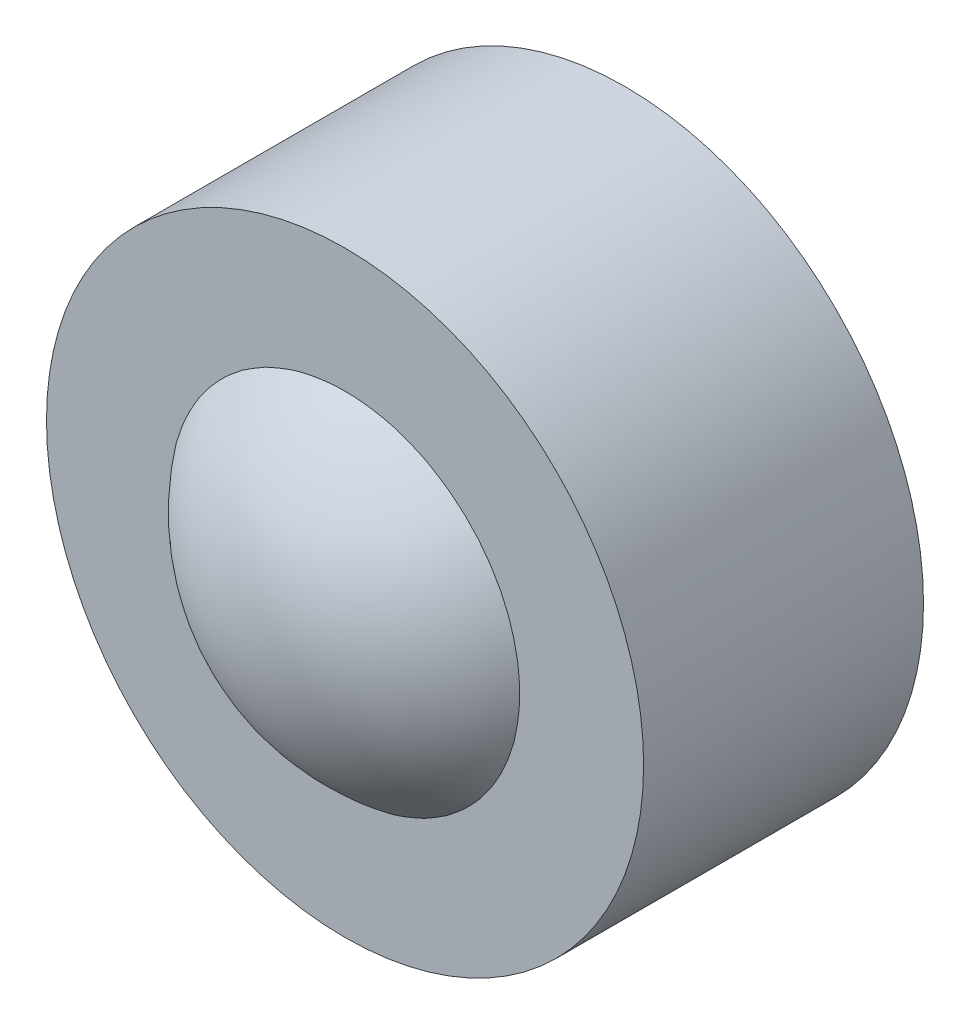
ISO-10303-21;
HEADER;
FILE_DESCRIPTION(('STEP AP214'),'2;1');
FILE_NAME('part.step','',(''),(''),'','','');
FILE_SCHEMA(('AUTOMOTIVE_DESIGN { 1 0 10303 214 1 1 1 1 }'));
ENDSEC;
DATA;
#1=APPLICATION_CONTEXT('core data for automotive mechanical design processes');
#2=APPLICATION_PROTOCOL_DEFINITION('international standard','automotive_design',2000,#1);
#3=PRODUCT_CONTEXT('',#1,'mechanical');
#4=PRODUCT('Part','Part','',(#3));
#5=PRODUCT_RELATED_PRODUCT_CATEGORY('part','',(#4));
#6=PRODUCT_DEFINITION_FORMATION('','',#4);
#7=PRODUCT_DEFINITION_CONTEXT('part definition',#1,'design');
#8=PRODUCT_DEFINITION('design','',#6,#7);
#9=PRODUCT_DEFINITION_SHAPE('','',#8);
#10=(LENGTH_UNIT() NAMED_UNIT(*) SI_UNIT(.MILLI.,.METRE.));
#11=(NAMED_UNIT(*) PLANE_ANGLE_UNIT() SI_UNIT($,.RADIAN.));
#12=(NAMED_UNIT(*) SI_UNIT($,.STERADIAN.) SOLID_ANGLE_UNIT());
#13=UNCERTAINTY_MEASURE_WITH_UNIT(LENGTH_MEASURE(1.E-05),#10,'distance_accuracy_value','');
#14=(GEOMETRIC_REPRESENTATION_CONTEXT(3) GLOBAL_UNCERTAINTY_ASSIGNED_CONTEXT((#13)) GLOBAL_UNIT_ASSIGNED_CONTEXT((#10,
#11,#12)) REPRESENTATION_CONTEXT('',''));
#15=CARTESIAN_POINT('',(0.,0.,0.));
#16=DIRECTION('',(0.,0.,1.));
#17=DIRECTION('',(1.,0.,0.));
#18=AXIS2_PLACEMENT_3D('',#15,#16,#17);
#19=CARTESIAN_POINT('',(0.,0.,0.));
#20=DIRECTION('',(0.,-1.,0.));
#21=DIRECTION('',(-1.,0.,0.));
#22=AXIS2_PLACEMENT_3D('',#19,#20,#21);
#23=SPHERICAL_SURFACE('',#22,3.);
#24=CARTESIAN_POINT('',(0.,-3.,0.));
#25=VERTEX_POINT('',#24);
#26=VERTEX_LOOP('',#25);
#27=FACE_BOUND('',#26,.T.);
#28=ADVANCED_FACE('F40',(#27),#23,.T.);
#29=CLOSED_SHELL('',(#28));
#30=MANIFOLD_SOLID_BREP('B2',#29);
#31=CARTESIAN_POINT('',(0.,0.,1.875));
#32=DIRECTION('',(0.,0.,1.));
#33=DIRECTION('',(1.,0.,0.));
#34=AXIS2_PLACEMENT_3D('',#31,#32,#33);
#35=PLANE('',#34);
#36=CARTESIAN_POINT('',(0.,0.,1.875));
#37=DIRECTION('',(0.,0.,1.));
#38=DIRECTION('',(1.,0.,0.));
#39=AXIS2_PLACEMENT_3D('',#36,#37,#38);
#40=CIRCLE('',#39,4.);
#41=CARTESIAN_POINT('',(4.,0.,1.875));
#42=VERTEX_POINT('',#41);
#43=EDGE_CURVE('E39',#42,#42,#40,.T.);
#44=ORIENTED_EDGE('',*,*,#43,.T.);
#45=EDGE_LOOP('',(#44));
#46=FACE_BOUND('',#45,.T.);
#47=CARTESIAN_POINT('',(0.,0.,1.875));
#48=DIRECTION('',(0.,0.,1.));
#49=DIRECTION('',(1.,0.,0.));
#50=AXIS2_PLACEMENT_3D('',#47,#48,#49);
#51=CIRCLE('',#50,2.);
#52=CARTESIAN_POINT('',(2.,0.,1.875));
#53=VERTEX_POINT('',#52);
#54=EDGE_CURVE('E65',#53,#53,#51,.T.);
#55=ORIENTED_EDGE('',*,*,#54,.F.);
#56=EDGE_LOOP('',(#55));
#57=FACE_BOUND('',#56,.T.);
#58=ADVANCED_FACE('F54',(#46,#57),#35,.T.);
#59=CARTESIAN_POINT('',(0.,0.,-1.875));
#60=DIRECTION('',(0.,0.,1.));
#61=DIRECTION('',(1.,0.,0.));
#62=AXIS2_PLACEMENT_3D('',#59,#60,#61);
#63=PLANE('',#62);
#64=CARTESIAN_POINT('',(0.,0.,-1.875));
#65=DIRECTION('',(0.,0.,1.));
#66=DIRECTION('',(1.,0.,0.));
#67=AXIS2_PLACEMENT_3D('',#64,#65,#66);
#68=CIRCLE('',#67,4.);
#69=CARTESIAN_POINT('',(4.,0.,-1.875));
#70=VERTEX_POINT('',#69);
#71=EDGE_CURVE('E58',#70,#70,#68,.T.);
#72=ORIENTED_EDGE('',*,*,#71,.F.);
#73=EDGE_LOOP('',(#72));
#74=FACE_BOUND('',#73,.T.);
#75=CARTESIAN_POINT('',(0.,0.,-1.875));
#76=DIRECTION('',(0.,0.,1.));
#77=DIRECTION('',(1.,0.,0.));
#78=AXIS2_PLACEMENT_3D('',#75,#76,#77);
#79=CIRCLE('',#78,2.);
#80=CARTESIAN_POINT('',(2.,0.,-1.875));
#81=VERTEX_POINT('',#80);
#82=EDGE_CURVE('E67',#81,#81,#79,.T.);
#83=ORIENTED_EDGE('',*,*,#82,.T.);
#84=EDGE_LOOP('',(#83));
#85=FACE_BOUND('',#84,.T.);
#86=ADVANCED_FACE('F77',(#74,#85),#63,.F.);
#87=CARTESIAN_POINT('',(0.,0.,1.875));
#88=DIRECTION('',(0.,0.,-1.));
#89=DIRECTION('',(-1.,0.,0.));
#90=AXIS2_PLACEMENT_3D('',#87,#88,#89);
#91=CYLINDRICAL_SURFACE('',#90,4.);
#92=ORIENTED_EDGE('',*,*,#43,.F.);
#93=EDGE_LOOP('',(#92));
#94=FACE_BOUND('',#93,.T.);
#95=ORIENTED_EDGE('',*,*,#71,.T.);
#96=EDGE_LOOP('',(#95));
#97=FACE_BOUND('',#96,.T.);
#98=ADVANCED_FACE('F56',(#94,#97),#91,.T.);
#99=CARTESIAN_POINT('',(0.,0.,1.875));
#100=DIRECTION('',(0.,0.,-1.));
#101=DIRECTION('',(-1.,0.,0.));
#102=AXIS2_PLACEMENT_3D('',#99,#100,#101);
#103=CYLINDRICAL_SURFACE('',#102,2.);
#104=ORIENTED_EDGE('',*,*,#54,.T.);
#105=EDGE_LOOP('',(#104));
#106=FACE_BOUND('',#105,.T.);
#107=ORIENTED_EDGE('',*,*,#82,.F.);
#108=EDGE_LOOP('',(#107));
#109=FACE_BOUND('',#108,.T.);
#110=ADVANCED_FACE('F73',(#106,#109),#103,.F.);
#111=CLOSED_SHELL('',(#58,#86,#98,#110));
#112=MANIFOLD_SOLID_BREP('B6',#111);
#113=ADVANCED_BREP_SHAPE_REPRESENTATION('',(#18,#30,#112),#14);
#114=SHAPE_DEFINITION_REPRESENTATION(#9,#113);
ENDSEC;
END-ISO-10303-21;
